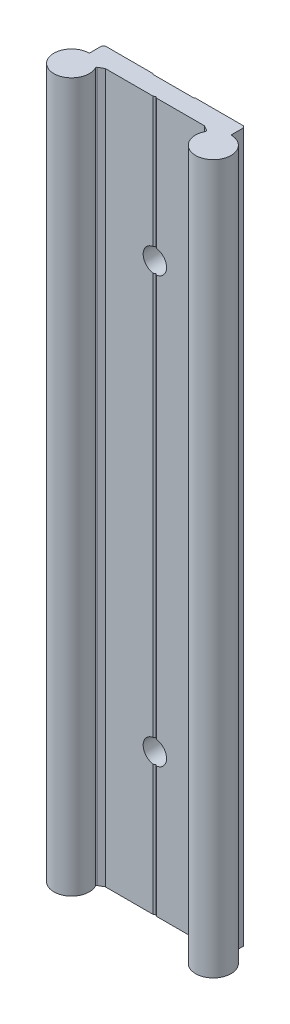
ISO-10303-21;
HEADER;
FILE_DESCRIPTION(('STEP AP214'),'2;1');
FILE_NAME('part.step','',(''),(''),'','','');
FILE_SCHEMA(('AUTOMOTIVE_DESIGN { 1 0 10303 214 1 1 1 1 }'));
ENDSEC;
DATA;
#1=APPLICATION_CONTEXT('core data for automotive mechanical design processes');
#2=APPLICATION_PROTOCOL_DEFINITION('international standard','automotive_design',2000,#1);
#3=PRODUCT_CONTEXT('',#1,'mechanical');
#4=PRODUCT('Part','Part','',(#3));
#5=PRODUCT_RELATED_PRODUCT_CATEGORY('part','',(#4));
#6=PRODUCT_DEFINITION_FORMATION('','',#4);
#7=PRODUCT_DEFINITION_CONTEXT('part definition',#1,'design');
#8=PRODUCT_DEFINITION('design','',#6,#7);
#9=PRODUCT_DEFINITION_SHAPE('','',#8);
#10=(LENGTH_UNIT() NAMED_UNIT(*) SI_UNIT(.MILLI.,.METRE.));
#11=(NAMED_UNIT(*) PLANE_ANGLE_UNIT() SI_UNIT($,.RADIAN.));
#12=(NAMED_UNIT(*) SI_UNIT($,.STERADIAN.) SOLID_ANGLE_UNIT());
#13=UNCERTAINTY_MEASURE_WITH_UNIT(LENGTH_MEASURE(1.E-05),#10,'distance_accuracy_value','');
#14=(GEOMETRIC_REPRESENTATION_CONTEXT(3) GLOBAL_UNCERTAINTY_ASSIGNED_CONTEXT((#13)) GLOBAL_UNIT_ASSIGNED_CONTEXT((#10,
#11,#12)) REPRESENTATION_CONTEXT('',''));
#15=CARTESIAN_POINT('',(0.,0.,0.));
#16=DIRECTION('',(0.,0.,1.));
#17=DIRECTION('',(1.,0.,0.));
#18=AXIS2_PLACEMENT_3D('',#15,#16,#17);
#19=CARTESIAN_POINT('',(6.,0.,0.));
#20=DIRECTION('',(-0.707106781186547,0.,-0.707106781186548));
#21=DIRECTION('',(-0.707106781186548,0.,0.707106781186547));
#22=AXIS2_PLACEMENT_3D('',#19,#20,#21);
#23=PLANE('',#22);
#24=DIRECTION('',(-0.707106781186548,0.,0.707106781186547));
#25=VECTOR('',#24,1.);
#26=CARTESIAN_POINT('',(5.9,0.,0.1));
#27=LINE('',#26,#25);
#28=CARTESIAN_POINT('',(6.,0.,0.));
#29=VERTEX_POINT('',#28);
#30=CARTESIAN_POINT('',(5.8,0.,0.2));
#31=VERTEX_POINT('',#30);
#32=EDGE_CURVE('E385',#29,#31,#27,.T.);
#33=ORIENTED_EDGE('',*,*,#32,.T.);
#34=DIRECTION('',(0.,-1.,0.));
#35=VECTOR('',#34,1.);
#36=CARTESIAN_POINT('',(5.8,100.,0.2));
#37=LINE('',#36,#35);
#38=CARTESIAN_POINT('',(5.8,200.,0.2));
#39=VERTEX_POINT('',#38);
#40=EDGE_CURVE('E313',#39,#31,#37,.T.);
#41=ORIENTED_EDGE('',*,*,#40,.F.);
#42=DIRECTION('',(0.707106781186548,0.,-0.707106781186547));
#43=VECTOR('',#42,1.);
#44=CARTESIAN_POINT('',(5.9,200.,0.1));
#45=LINE('',#44,#43);
#46=CARTESIAN_POINT('',(6.,200.,0.));
#47=VERTEX_POINT('',#46);
#48=EDGE_CURVE('E390',#39,#47,#45,.T.);
#49=ORIENTED_EDGE('',*,*,#48,.T.);
#50=DIRECTION('',(0.,1.,0.));
#51=VECTOR('',#50,1.);
#52=CARTESIAN_POINT('',(6.,100.,0.));
#53=LINE('',#52,#51);
#54=EDGE_CURVE('E238',#29,#47,#53,.T.);
#55=ORIENTED_EDGE('',*,*,#54,.F.);
#56=EDGE_LOOP('',(#33,#41,#49,#55));
#57=FACE_BOUND('',#56,.T.);
#58=ADVANCED_FACE('F16',(#57),#23,.T.);
#59=CARTESIAN_POINT('',(20.,0.,0.5));
#60=DIRECTION('',(0.707106781186547,0.,-0.707106781186548));
#61=DIRECTION('',(-0.707106781186548,0.,-0.707106781186547));
#62=AXIS2_PLACEMENT_3D('',#59,#60,#61);
#63=PLANE('',#62);
#64=DIRECTION('',(-0.707106781186548,0.,-0.707106781186547));
#65=VECTOR('',#64,1.);
#66=CARTESIAN_POINT('',(19.75,0.,0.25));
#67=LINE('',#66,#65);
#68=CARTESIAN_POINT('',(20.,0.,0.5));
#69=VERTEX_POINT('',#68);
#70=CARTESIAN_POINT('',(19.5,0.,0.));
#71=VERTEX_POINT('',#70);
#72=EDGE_CURVE('E142',#69,#71,#67,.T.);
#73=ORIENTED_EDGE('',*,*,#72,.T.);
#74=DIRECTION('',(0.,-1.,0.));
#75=VECTOR('',#74,1.);
#76=CARTESIAN_POINT('',(19.5,100.,0.));
#77=LINE('',#76,#75);
#78=CARTESIAN_POINT('',(19.5,200.,0.));
#79=VERTEX_POINT('',#78);
#80=EDGE_CURVE('E192',#79,#71,#77,.T.);
#81=ORIENTED_EDGE('',*,*,#80,.F.);
#82=DIRECTION('',(0.707106781186548,0.,0.707106781186547));
#83=VECTOR('',#82,1.);
#84=CARTESIAN_POINT('',(19.75,200.,0.25));
#85=LINE('',#84,#83);
#86=CARTESIAN_POINT('',(20.,200.,0.5));
#87=VERTEX_POINT('',#86);
#88=EDGE_CURVE('E381',#79,#87,#85,.T.);
#89=ORIENTED_EDGE('',*,*,#88,.T.);
#90=DIRECTION('',(0.,1.,0.));
#91=VECTOR('',#90,1.);
#92=CARTESIAN_POINT('',(20.,100.,0.5));
#93=LINE('',#92,#91);
#94=EDGE_CURVE('E152',#69,#87,#93,.T.);
#95=ORIENTED_EDGE('',*,*,#94,.F.);
#96=EDGE_LOOP('',(#73,#81,#89,#95));
#97=FACE_BOUND('',#96,.T.);
#98=ADVANCED_FACE('F529',(#97),#63,.T.);
#99=CARTESIAN_POINT('',(20.3,0.,3.70849738000001));
#100=DIRECTION('',(0.,1.,0.));
#101=DIRECTION('',(0.,0.,1.));
#102=AXIS2_PLACEMENT_3D('',#99,#100,#101);
#103=CYLINDRICAL_SURFACE('',#102,0.300000003529736);
#104=CARTESIAN_POINT('',(20.3,0.,3.70849738000001));
#105=DIRECTION('',(0.,1.,0.));
#106=DIRECTION('',(0.,0.,1.));
#107=AXIS2_PLACEMENT_3D('',#104,#105,#106);
#108=CIRCLE('',#107,0.300000003529736);
#109=CARTESIAN_POINT('',(20.2830188688939,0.,4.00801639931802));
#110=VERTEX_POINT('',#109);
#111=CARTESIAN_POINT('',(20.,0.,3.70849738));
#112=VERTEX_POINT('',#111);
#113=EDGE_CURVE('E141',#110,#112,#108,.F.);
#114=ORIENTED_EDGE('',*,*,#113,.T.);
#115=DIRECTION('',(0.,-1.,0.));
#116=VECTOR('',#115,1.);
#117=CARTESIAN_POINT('',(20.,100.,3.70849738));
#118=LINE('',#117,#116);
#119=CARTESIAN_POINT('',(20.,200.,3.70849738));
#120=VERTEX_POINT('',#119);
#121=EDGE_CURVE('E139',#120,#112,#118,.T.);
#122=ORIENTED_EDGE('',*,*,#121,.F.);
#123=CARTESIAN_POINT('',(20.3,200.,3.70849738000001));
#124=DIRECTION('',(0.,1.,0.));
#125=DIRECTION('',(0.,0.,1.));
#126=AXIS2_PLACEMENT_3D('',#123,#124,#125);
#127=CIRCLE('',#126,0.300000003529736);
#128=CARTESIAN_POINT('',(20.283018868894,200.,4.00801639931803));
#129=VERTEX_POINT('',#128);
#130=EDGE_CURVE('E20',#120,#129,#127,.T.);
#131=ORIENTED_EDGE('',*,*,#130,.T.);
#132=DIRECTION('',(0.,1.,0.));
#133=VECTOR('',#132,1.);
#134=CARTESIAN_POINT('',(20.28301887007,100.,4.00801639876542));
#135=LINE('',#134,#133);
#136=EDGE_CURVE('E137',#110,#129,#135,.T.);
#137=ORIENTED_EDGE('',*,*,#136,.F.);
#138=EDGE_LOOP('',(#114,#122,#131,#137));
#139=FACE_BOUND('',#138,.T.);
#140=ADVANCED_FACE('F136',(#139),#103,.F.);
#141=CARTESIAN_POINT('',(15.28152165,0.,6.58629703));
#142=DIRECTION('',(0.,1.,0.));
#143=DIRECTION('',(0.,0.,1.));
#144=AXIS2_PLACEMENT_3D('',#141,#142,#143);
#145=CYLINDRICAL_SURFACE('',#144,0.299999999016778);
#146=CARTESIAN_POINT('',(15.28152165,0.,6.58629703));
#147=DIRECTION('',(0.,1.,0.));
#148=DIRECTION('',(0.,0.,1.));
#149=AXIS2_PLACEMENT_3D('',#146,#147,#148);
#150=CIRCLE('',#149,0.299999999016778);
#151=CARTESIAN_POINT('',(15.4315216497557,0.,6.32648940985893));
#152=VERTEX_POINT('',#151);
#153=CARTESIAN_POINT('',(15.5486053297356,0.,6.722921728024));
#154=VERTEX_POINT('',#153);
#155=EDGE_CURVE('E229',#152,#154,#150,.F.);
#156=ORIENTED_EDGE('',*,*,#155,.T.);
#157=DIRECTION('',(0.,-1.,0.));
#158=VECTOR('',#157,1.);
#159=CARTESIAN_POINT('',(15.54860533,100.,6.72292172999999));
#160=LINE('',#159,#158);
#161=CARTESIAN_POINT('',(15.5486053297356,200.,6.72292172802402));
#162=VERTEX_POINT('',#161);
#163=EDGE_CURVE('E151',#162,#154,#160,.T.);
#164=ORIENTED_EDGE('',*,*,#163,.F.);
#165=CARTESIAN_POINT('',(15.28152165,200.,6.58629703));
#166=DIRECTION('',(0.,1.,0.));
#167=DIRECTION('',(0.,0.,1.));
#168=AXIS2_PLACEMENT_3D('',#165,#166,#167);
#169=CIRCLE('',#168,0.299999999016778);
#170=CARTESIAN_POINT('',(15.4315216497557,200.,6.32648940985893));
#171=VERTEX_POINT('',#170);
#172=EDGE_CURVE('E157',#162,#171,#169,.T.);
#173=ORIENTED_EDGE('',*,*,#172,.T.);
#174=DIRECTION('',(0.,1.,0.));
#175=VECTOR('',#174,1.);
#176=CARTESIAN_POINT('',(15.43152165,100.,6.32648941));
#177=LINE('',#176,#175);
#178=EDGE_CURVE('E366',#152,#171,#177,.T.);
#179=ORIENTED_EDGE('',*,*,#178,.F.);
#180=EDGE_LOOP('',(#156,#164,#173,#179));
#181=FACE_BOUND('',#180,.T.);
#182=ADVANCED_FACE('F538',(#181),#145,.F.);
#183=CARTESIAN_POINT('',(0.,43.26190128606,5.21132487));
#184=DIRECTION('',(-0.499999994031163,0.,0.866025407230548));
#185=DIRECTION('',(0.866025407230548,0.,0.499999994031163));
#186=AXIS2_PLACEMENT_3D('',#183,#184,#185);
#187=PLANE('',#186);
#188=CARTESIAN_POINT('',(0.,40.,5.21132487));
#189=DIRECTION('',(-0.499999994031163,0.,0.866025407230548));
#190=DIRECTION('',(-0.866025407230548,0.,-0.499999994031163));
#191=AXIS2_PLACEMENT_3D('',#188,#189,#190);
#192=ELLIPSE('',#191,3.81051176148865,3.3);
#193=CARTESIAN_POINT('',(0.500000000000001,43.26190128606,5.5));
#194=VERTEX_POINT('',#193);
#195=CARTESIAN_POINT('',(0.,43.3,5.21132487));
#196=VERTEX_POINT('',#195);
#197=EDGE_CURVE('E212',#194,#196,#192,.T.);
#198=ORIENTED_EDGE('',*,*,#197,.F.);
#199=DIRECTION('',(0.,-1.,0.));
#200=VECTOR('',#199,1.);
#201=CARTESIAN_POINT('',(0.5,100.,5.5));
#202=LINE('',#201,#200);
#203=CARTESIAN_POINT('',(0.5,156.73809871394,5.5));
#204=VERTEX_POINT('',#203);
#205=EDGE_CURVE('E185',#204,#194,#202,.T.);
#206=ORIENTED_EDGE('',*,*,#205,.F.);
#207=CARTESIAN_POINT('',(0.,160.,5.21132487));
#208=DIRECTION('',(-0.499999994031163,0.,0.866025407230548));
#209=DIRECTION('',(-0.866025407230548,0.,-0.499999994031163));
#210=AXIS2_PLACEMENT_3D('',#207,#208,#209);
#211=ELLIPSE('',#210,3.81051176148866,3.30000000000001);
#212=CARTESIAN_POINT('',(0.,156.7,5.21132487));
#213=VERTEX_POINT('',#212);
#214=EDGE_CURVE('E226',#213,#204,#211,.T.);
#215=ORIENTED_EDGE('',*,*,#214,.F.);
#216=DIRECTION('',(0.,1.,0.));
#217=VECTOR('',#216,1.);
#218=CARTESIAN_POINT('',(0.,100.,5.21132487));
#219=LINE('',#218,#217);
#220=EDGE_CURVE('E208',#196,#213,#219,.T.);
#221=ORIENTED_EDGE('',*,*,#220,.F.);
#222=EDGE_LOOP('',(#198,#206,#215,#221));
#223=FACE_BOUND('',#222,.T.);
#224=ADVANCED_FACE('F616',(#223),#187,.T.);
#225=CARTESIAN_POINT('',(0.,0.,5.21132487));
#226=DIRECTION('',(-0.499999994031163,0.,0.866025407230548));
#227=DIRECTION('',(0.866025407230548,0.,0.499999994031163));
#228=AXIS2_PLACEMENT_3D('',#225,#226,#227);
#229=PLANE('',#228);
#230=DIRECTION('',(0.866025407230548,0.,0.499999994031163));
#231=VECTOR('',#230,1.);
#232=CARTESIAN_POINT('',(0.25,0.,5.355662435));
#233=LINE('',#232,#231);
#234=CARTESIAN_POINT('',(0.,0.,5.21132487));
#235=VERTEX_POINT('',#234);
#236=CARTESIAN_POINT('',(0.5,0.,5.5));
#237=VERTEX_POINT('',#236);
#238=EDGE_CURVE('E231',#235,#237,#233,.T.);
#239=ORIENTED_EDGE('',*,*,#238,.T.);
#240=DIRECTION('',(0.,-1.,0.));
#241=VECTOR('',#240,1.);
#242=CARTESIAN_POINT('',(0.5,100.,5.5));
#243=LINE('',#242,#241);
#244=CARTESIAN_POINT('',(0.5,36.73809871394,5.5));
#245=VERTEX_POINT('',#244);
#246=EDGE_CURVE('E184',#245,#237,#243,.T.);
#247=ORIENTED_EDGE('',*,*,#246,.F.);
#248=CARTESIAN_POINT('',(0.,40.,5.21132487));
#249=DIRECTION('',(-0.499999994031163,0.,0.866025407230548));
#250=DIRECTION('',(-0.866025407230548,0.,-0.499999994031163));
#251=AXIS2_PLACEMENT_3D('',#248,#249,#250);
#252=ELLIPSE('',#251,3.81051176148865,3.3);
#253=CARTESIAN_POINT('',(0.,36.7,5.21132487));
#254=VERTEX_POINT('',#253);
#255=EDGE_CURVE('E214',#254,#245,#252,.T.);
#256=ORIENTED_EDGE('',*,*,#255,.F.);
#257=DIRECTION('',(0.,1.,0.));
#258=VECTOR('',#257,1.);
#259=CARTESIAN_POINT('',(0.,18.36904935697,5.21132487));
#260=LINE('',#259,#258);
#261=EDGE_CURVE('E219',#235,#254,#260,.T.);
#262=ORIENTED_EDGE('',*,*,#261,.F.);
#263=EDGE_LOOP('',(#239,#247,#256,#262));
#264=FACE_BOUND('',#263,.T.);
#265=ADVANCED_FACE('F612',(#264),#229,.T.);
#266=CARTESIAN_POINT('',(14.,0.,5.5));
#267=DIRECTION('',(-0.500000000009857,0.,0.866025403778748));
#268=DIRECTION('',(0.866025403778748,0.,0.500000000009857));
#269=AXIS2_PLACEMENT_3D('',#266,#267,#268);
#270=PLANE('',#269);
#271=DIRECTION('',(0.866025403778748,0.,0.500000000009857));
#272=VECTOR('',#271,1.);
#273=CARTESIAN_POINT('',(14.715760825,0.,5.913244705));
#274=LINE('',#273,#272);
#275=CARTESIAN_POINT('',(14.,0.,5.5));
#276=VERTEX_POINT('',#275);
#277=EDGE_CURVE('E419',#276,#152,#274,.T.);
#278=ORIENTED_EDGE('',*,*,#277,.T.);
#279=ORIENTED_EDGE('',*,*,#178,.T.);
#280=DIRECTION('',(-0.866025403778748,0.,-0.500000000009857));
#281=VECTOR('',#280,1.);
#282=CARTESIAN_POINT('',(14.715760825,200.,5.913244705));
#283=LINE('',#282,#281);
#284=CARTESIAN_POINT('',(14.,200.,5.5));
#285=VERTEX_POINT('',#284);
#286=EDGE_CURVE('E373',#171,#285,#283,.T.);
#287=ORIENTED_EDGE('',*,*,#286,.T.);
#288=DIRECTION('',(0.,1.,0.));
#289=VECTOR('',#288,1.);
#290=CARTESIAN_POINT('',(14.,100.,5.5));
#291=LINE('',#290,#289);
#292=EDGE_CURVE('E296',#276,#285,#291,.T.);
#293=ORIENTED_EDGE('',*,*,#292,.F.);
#294=EDGE_LOOP('',(#278,#279,#287,#293));
#295=FACE_BOUND('',#294,.T.);
#296=ADVANCED_FACE('F608',(#295),#270,.T.);
#297=CARTESIAN_POINT('',(0.,163.26190128606,5.21132487));
#298=DIRECTION('',(-0.499999994031163,0.,0.866025407230548));
#299=DIRECTION('',(0.866025407230548,0.,0.499999994031163));
#300=AXIS2_PLACEMENT_3D('',#297,#298,#299);
#301=PLANE('',#300);
#302=DIRECTION('',(-0.866025407230548,0.,-0.499999994031163));
#303=VECTOR('',#302,1.);
#304=CARTESIAN_POINT('',(0.25,200.,5.355662435));
#305=LINE('',#304,#303);
#306=CARTESIAN_POINT('',(0.5,200.,5.5));
#307=VERTEX_POINT('',#306);
#308=CARTESIAN_POINT('',(0.,200.,5.21132487));
#309=VERTEX_POINT('',#308);
#310=EDGE_CURVE('E228',#307,#309,#305,.T.);
#311=ORIENTED_EDGE('',*,*,#310,.T.);
#312=DIRECTION('',(0.,1.,0.));
#313=VECTOR('',#312,1.);
#314=CARTESIAN_POINT('',(0.,181.63095064303,5.21132487));
#315=LINE('',#314,#313);
#316=CARTESIAN_POINT('',(0.,163.3,5.21132487));
#317=VERTEX_POINT('',#316);
#318=EDGE_CURVE('E223',#317,#309,#315,.T.);
#319=ORIENTED_EDGE('',*,*,#318,.F.);
#320=CARTESIAN_POINT('',(0.,160.,5.21132487));
#321=DIRECTION('',(-0.499999994031163,0.,0.866025407230548));
#322=DIRECTION('',(-0.866025407230548,0.,-0.499999994031163));
#323=AXIS2_PLACEMENT_3D('',#320,#321,#322);
#324=ELLIPSE('',#323,3.81051176148866,3.30000000000001);
#325=CARTESIAN_POINT('',(0.5,163.26190128606,5.5));
#326=VERTEX_POINT('',#325);
#327=EDGE_CURVE('E224',#326,#317,#324,.T.);
#328=ORIENTED_EDGE('',*,*,#327,.F.);
#329=DIRECTION('',(0.,-1.,0.));
#330=VECTOR('',#329,1.);
#331=CARTESIAN_POINT('',(0.5,100.,5.5));
#332=LINE('',#331,#330);
#333=EDGE_CURVE('E180',#307,#326,#332,.T.);
#334=ORIENTED_EDGE('',*,*,#333,.F.);
#335=EDGE_LOOP('',(#311,#319,#328,#334));
#336=FACE_BOUND('',#335,.T.);
#337=ADVANCED_FACE('F604',(#336),#301,.T.);
#338=CARTESIAN_POINT('',(0.,160.,5.5));
#339=DIRECTION('',(0.,0.,-1.));
#340=DIRECTION('',(-1.,0.,0.));
#341=AXIS2_PLACEMENT_3D('',#338,#339,#340);
#342=CYLINDRICAL_SURFACE('',#341,3.30000000000001);
#343=CARTESIAN_POINT('',(0.,160.,5.5));
#344=DIRECTION('',(0.,0.,-1.));
#345=DIRECTION('',(-1.,0.,0.));
#346=AXIS2_PLACEMENT_3D('',#343,#344,#345);
#347=CIRCLE('',#346,3.30000000000001);
#348=EDGE_CURVE('E186',#326,#204,#347,.T.);
#349=ORIENTED_EDGE('',*,*,#348,.F.);
#350=ORIENTED_EDGE('',*,*,#327,.T.);
#351=CARTESIAN_POINT('',(0.,160.,5.21132487));
#352=DIRECTION('',(0.499999994031163,0.,0.866025407230548));
#353=DIRECTION('',(0.866025407230548,0.,-0.499999994031163));
#354=AXIS2_PLACEMENT_3D('',#351,#352,#353);
#355=ELLIPSE('',#354,3.81051176148866,3.30000000000001);
#356=CARTESIAN_POINT('',(-0.5,163.26190128606,5.5));
#357=VERTEX_POINT('',#356);
#358=EDGE_CURVE('E220',#357,#317,#355,.F.);
#359=ORIENTED_EDGE('',*,*,#358,.F.);
#360=CARTESIAN_POINT('',(0.,160.,5.5));
#361=DIRECTION('',(0.,0.,-1.));
#362=DIRECTION('',(-1.,0.,0.));
#363=AXIS2_PLACEMENT_3D('',#360,#361,#362);
#364=CIRCLE('',#363,3.30000000000001);
#365=CARTESIAN_POINT('',(-0.5,156.73809871394,5.5));
#366=VERTEX_POINT('',#365);
#367=EDGE_CURVE('E176',#366,#357,#364,.T.);
#368=ORIENTED_EDGE('',*,*,#367,.F.);
#369=CARTESIAN_POINT('',(0.,160.,5.21132487));
#370=DIRECTION('',(0.499999994031163,0.,0.866025407230548));
#371=DIRECTION('',(0.866025407230548,0.,-0.499999994031163));
#372=AXIS2_PLACEMENT_3D('',#369,#370,#371);
#373=ELLIPSE('',#372,3.81051176148866,3.30000000000001);
#374=EDGE_CURVE('E209',#213,#366,#373,.F.);
#375=ORIENTED_EDGE('',*,*,#374,.F.);
#376=ORIENTED_EDGE('',*,*,#214,.T.);
#377=EDGE_LOOP('',(#349,#350,#359,#368,#375,#376));
#378=FACE_BOUND('',#377,.T.);
#379=CARTESIAN_POINT('',(0.,160.,0.2));
#380=DIRECTION('',(0.,0.,-1.));
#381=DIRECTION('',(-1.,0.,0.));
#382=AXIS2_PLACEMENT_3D('',#379,#380,#381);
#383=CIRCLE('',#382,3.30000000000001);
#384=CARTESIAN_POINT('',(-3.30000000000001,160.,0.2));
#385=VERTEX_POINT('',#384);
#386=EDGE_CURVE('E193',#385,#385,#383,.F.);
#387=ORIENTED_EDGE('',*,*,#386,.F.);
#388=EDGE_LOOP('',(#387));
#389=FACE_BOUND('',#388,.T.);
#390=ADVANCED_FACE('F600',(#378,#389),#342,.F.);
#391=CARTESIAN_POINT('',(-0.5,163.26190128606,5.5));
#392=DIRECTION('',(0.499999994031163,0.,0.866025407230548));
#393=DIRECTION('',(0.866025407230548,0.,-0.499999994031163));
#394=AXIS2_PLACEMENT_3D('',#391,#392,#393);
#395=PLANE('',#394);
#396=DIRECTION('',(-0.866025407230548,0.,0.499999994031163));
#397=VECTOR('',#396,1.);
#398=CARTESIAN_POINT('',(-0.25,200.,5.355662435));
#399=LINE('',#398,#397);
#400=CARTESIAN_POINT('',(-0.5,200.,5.5));
#401=VERTEX_POINT('',#400);
#402=EDGE_CURVE('E352',#309,#401,#399,.T.);
#403=ORIENTED_EDGE('',*,*,#402,.T.);
#404=DIRECTION('',(0.,1.,0.));
#405=VECTOR('',#404,1.);
#406=CARTESIAN_POINT('',(-0.5,100.,5.5));
#407=LINE('',#406,#405);
#408=EDGE_CURVE('E179',#357,#401,#407,.T.);
#409=ORIENTED_EDGE('',*,*,#408,.F.);
#410=ORIENTED_EDGE('',*,*,#358,.T.);
#411=ORIENTED_EDGE('',*,*,#318,.T.);
#412=EDGE_LOOP('',(#403,#409,#410,#411));
#413=FACE_BOUND('',#412,.T.);
#414=ADVANCED_FACE('F596',(#413),#395,.T.);
#415=CARTESIAN_POINT('',(-15.4315216508515,0.,6.3264894104916));
#416=DIRECTION('',(0.500000000009856,0.,0.866025403778748));
#417=DIRECTION('',(0.866025403778748,0.,-0.500000000009856));
#418=AXIS2_PLACEMENT_3D('',#415,#416,#417);
#419=PLANE('',#418);
#420=DIRECTION('',(0.866025403778748,0.,-0.500000000009856));
#421=VECTOR('',#420,1.);
#422=CARTESIAN_POINT('',(-14.7157608254257,0.,5.9132447052458));
#423=LINE('',#422,#421);
#424=CARTESIAN_POINT('',(-15.4315216503233,0.,6.32648940887573));
#425=VERTEX_POINT('',#424);
#426=CARTESIAN_POINT('',(-14.,0.,5.5));
#427=VERTEX_POINT('',#426);
#428=EDGE_CURVE('E341',#425,#427,#423,.T.);
#429=ORIENTED_EDGE('',*,*,#428,.T.);
#430=DIRECTION('',(0.,-1.,0.));
#431=VECTOR('',#430,1.);
#432=CARTESIAN_POINT('',(-14.,100.,5.5));
#433=LINE('',#432,#431);
#434=CARTESIAN_POINT('',(-14.,200.,5.5));
#435=VERTEX_POINT('',#434);
#436=EDGE_CURVE('E287',#435,#427,#433,.T.);
#437=ORIENTED_EDGE('',*,*,#436,.F.);
#438=DIRECTION('',(-0.866025403778748,0.,0.500000000009856));
#439=VECTOR('',#438,1.);
#440=CARTESIAN_POINT('',(-14.7157608254257,200.,5.9132447052458));
#441=LINE('',#440,#439);
#442=CARTESIAN_POINT('',(-15.4315216503233,200.,6.32648940887573));
#443=VERTEX_POINT('',#442);
#444=EDGE_CURVE('E357',#435,#443,#441,.T.);
#445=ORIENTED_EDGE('',*,*,#444,.T.);
#446=DIRECTION('',(0.,1.,0.));
#447=VECTOR('',#446,1.);
#448=CARTESIAN_POINT('',(-15.4315216511353,100.,6.32648940803359));
#449=LINE('',#448,#447);
#450=EDGE_CURVE('E200',#425,#443,#449,.T.);
#451=ORIENTED_EDGE('',*,*,#450,.F.);
#452=EDGE_LOOP('',(#429,#437,#445,#451));
#453=FACE_BOUND('',#452,.T.);
#454=ADVANCED_FACE('F592',(#453),#419,.T.);
#455=CARTESIAN_POINT('',(-0.5,0.,5.5));
#456=DIRECTION('',(0.499999994031163,0.,0.866025407230548));
#457=DIRECTION('',(0.866025407230548,0.,-0.499999994031163));
#458=AXIS2_PLACEMENT_3D('',#455,#456,#457);
#459=PLANE('',#458);
#460=DIRECTION('',(0.866025407230548,0.,-0.499999994031163));
#461=VECTOR('',#460,1.);
#462=CARTESIAN_POINT('',(-0.25,0.,5.355662435));
#463=LINE('',#462,#461);
#464=CARTESIAN_POINT('',(-0.5,0.,5.5));
#465=VERTEX_POINT('',#464);
#466=EDGE_CURVE('E336',#465,#235,#463,.T.);
#467=ORIENTED_EDGE('',*,*,#466,.T.);
#468=ORIENTED_EDGE('',*,*,#261,.T.);
#469=CARTESIAN_POINT('',(0.,40.,5.21132487));
#470=DIRECTION('',(0.499999994031163,0.,0.866025407230548));
#471=DIRECTION('',(0.866025407230548,0.,-0.499999994031163));
#472=AXIS2_PLACEMENT_3D('',#469,#470,#471);
#473=ELLIPSE('',#472,3.81051176148865,3.3);
#474=CARTESIAN_POINT('',(-0.5,36.73809871394,5.5));
#475=VERTEX_POINT('',#474);
#476=EDGE_CURVE('E216',#475,#254,#473,.T.);
#477=ORIENTED_EDGE('',*,*,#476,.F.);
#478=DIRECTION('',(0.,1.,0.));
#479=VECTOR('',#478,1.);
#480=CARTESIAN_POINT('',(-0.5,100.,5.5));
#481=LINE('',#480,#479);
#482=EDGE_CURVE('E175',#465,#475,#481,.T.);
#483=ORIENTED_EDGE('',*,*,#482,.F.);
#484=EDGE_LOOP('',(#467,#468,#477,#483));
#485=FACE_BOUND('',#484,.T.);
#486=ADVANCED_FACE('F588',(#485),#459,.T.);
#487=CARTESIAN_POINT('',(0.,40.,5.5));
#488=DIRECTION('',(0.,0.,-1.));
#489=DIRECTION('',(-1.,0.,0.));
#490=AXIS2_PLACEMENT_3D('',#487,#488,#489);
#491=CYLINDRICAL_SURFACE('',#490,3.3);
#492=CARTESIAN_POINT('',(0.,40.,5.5));
#493=DIRECTION('',(0.,0.,-1.));
#494=DIRECTION('',(-1.,0.,0.));
#495=AXIS2_PLACEMENT_3D('',#492,#493,#494);
#496=CIRCLE('',#495,3.3);
#497=EDGE_CURVE('E181',#194,#245,#496,.T.);
#498=ORIENTED_EDGE('',*,*,#497,.F.);
#499=ORIENTED_EDGE('',*,*,#197,.T.);
#500=CARTESIAN_POINT('',(0.,40.,5.21132487));
#501=DIRECTION('',(0.499999994031163,0.,0.866025407230548));
#502=DIRECTION('',(0.866025407230548,0.,-0.499999994031163));
#503=AXIS2_PLACEMENT_3D('',#500,#501,#502);
#504=ELLIPSE('',#503,3.81051176148865,3.3);
#505=CARTESIAN_POINT('',(-0.5,43.26190128606,5.5));
#506=VERTEX_POINT('',#505);
#507=EDGE_CURVE('E205',#506,#196,#504,.F.);
#508=ORIENTED_EDGE('',*,*,#507,.F.);
#509=CARTESIAN_POINT('',(0.,40.,5.5));
#510=DIRECTION('',(0.,0.,-1.));
#511=DIRECTION('',(-1.,0.,0.));
#512=AXIS2_PLACEMENT_3D('',#509,#510,#511);
#513=CIRCLE('',#512,3.3);
#514=EDGE_CURVE('E171',#475,#506,#513,.T.);
#515=ORIENTED_EDGE('',*,*,#514,.F.);
#516=ORIENTED_EDGE('',*,*,#476,.T.);
#517=ORIENTED_EDGE('',*,*,#255,.T.);
#518=EDGE_LOOP('',(#498,#499,#508,#515,#516,#517));
#519=FACE_BOUND('',#518,.T.);
#520=CARTESIAN_POINT('',(0.,40.,0.2));
#521=DIRECTION('',(0.,0.,-1.));
#522=DIRECTION('',(-1.,0.,0.));
#523=AXIS2_PLACEMENT_3D('',#520,#521,#522);
#524=CIRCLE('',#523,3.3);
#525=CARTESIAN_POINT('',(-3.3,40.,0.2));
#526=VERTEX_POINT('',#525);
#527=EDGE_CURVE('E189',#526,#526,#524,.F.);
#528=ORIENTED_EDGE('',*,*,#527,.F.);
#529=EDGE_LOOP('',(#528));
#530=FACE_BOUND('',#529,.T.);
#531=ADVANCED_FACE('F584',(#519,#530),#491,.F.);
#532=CARTESIAN_POINT('',(-0.5,43.26190128606,5.5));
#533=DIRECTION('',(0.499999994031163,0.,0.866025407230548));
#534=DIRECTION('',(0.866025407230548,0.,-0.499999994031163));
#535=AXIS2_PLACEMENT_3D('',#532,#533,#534);
#536=PLANE('',#535);
#537=ORIENTED_EDGE('',*,*,#507,.T.);
#538=ORIENTED_EDGE('',*,*,#220,.T.);
#539=ORIENTED_EDGE('',*,*,#374,.T.);
#540=DIRECTION('',(0.,1.,0.));
#541=VECTOR('',#540,1.);
#542=CARTESIAN_POINT('',(-0.5,100.,5.5));
#543=LINE('',#542,#541);
#544=EDGE_CURVE('E174',#506,#366,#543,.T.);
#545=ORIENTED_EDGE('',*,*,#544,.F.);
#546=EDGE_LOOP('',(#537,#538,#539,#545));
#547=FACE_BOUND('',#546,.T.);
#548=ADVANCED_FACE('F581',(#547),#536,.T.);
#549=CARTESIAN_POINT('',(-5.8,0.,0.2));
#550=DIRECTION('',(0.707106781186547,0.,-0.707106781186548));
#551=DIRECTION('',(-0.707106781186548,0.,-0.707106781186547));
#552=AXIS2_PLACEMENT_3D('',#549,#550,#551);
#553=PLANE('',#552);
#554=DIRECTION('',(-0.707106781186548,0.,-0.707106781186547));
#555=VECTOR('',#554,1.);
#556=CARTESIAN_POINT('',(-5.9,0.,0.1));
#557=LINE('',#556,#555);
#558=CARTESIAN_POINT('',(-5.8,0.,0.2));
#559=VERTEX_POINT('',#558);
#560=CARTESIAN_POINT('',(-6.,0.,0.));
#561=VERTEX_POINT('',#560);
#562=EDGE_CURVE('E318',#559,#561,#557,.T.);
#563=ORIENTED_EDGE('',*,*,#562,.T.);
#564=DIRECTION('',(0.,-1.,0.));
#565=VECTOR('',#564,1.);
#566=CARTESIAN_POINT('',(-6.,100.,0.));
#567=LINE('',#566,#565);
#568=CARTESIAN_POINT('',(-6.,200.,0.));
#569=VERTEX_POINT('',#568);
#570=EDGE_CURVE('E275',#569,#561,#567,.T.);
#571=ORIENTED_EDGE('',*,*,#570,.F.);
#572=DIRECTION('',(0.707106781186548,0.,0.707106781186547));
#573=VECTOR('',#572,1.);
#574=CARTESIAN_POINT('',(-5.9,200.,0.1));
#575=LINE('',#574,#573);
#576=CARTESIAN_POINT('',(-5.8,200.,0.2));
#577=VERTEX_POINT('',#576);
#578=EDGE_CURVE('E322',#569,#577,#575,.T.);
#579=ORIENTED_EDGE('',*,*,#578,.T.);
#580=DIRECTION('',(0.,1.,0.));
#581=VECTOR('',#580,1.);
#582=CARTESIAN_POINT('',(-5.8,100.,0.2));
#583=LINE('',#582,#581);
#584=EDGE_CURVE('E196',#559,#577,#583,.T.);
#585=ORIENTED_EDGE('',*,*,#584,.F.);
#586=EDGE_LOOP('',(#563,#571,#579,#585));
#587=FACE_BOUND('',#586,.T.);
#588=ADVANCED_FACE('F514',(#587),#553,.T.);
#589=CARTESIAN_POINT('',(-19.5,0.,0.));
#590=DIRECTION('',(-0.707106781186547,0.,-0.707106781186548));
#591=DIRECTION('',(-0.707106781186548,0.,0.707106781186547));
#592=AXIS2_PLACEMENT_3D('',#589,#590,#591);
#593=PLANE('',#592);
#594=DIRECTION('',(-0.707106781186548,0.,0.707106781186547));
#595=VECTOR('',#594,1.);
#596=CARTESIAN_POINT('',(-19.75,0.,0.25));
#597=LINE('',#596,#595);
#598=CARTESIAN_POINT('',(-19.5,0.,0.));
#599=VERTEX_POINT('',#598);
#600=CARTESIAN_POINT('',(-20.,0.,0.5));
#601=VERTEX_POINT('',#600);
#602=EDGE_CURVE('E204',#599,#601,#597,.T.);
#603=ORIENTED_EDGE('',*,*,#602,.T.);
#604=DIRECTION('',(0.,-1.,0.));
#605=VECTOR('',#604,1.);
#606=CARTESIAN_POINT('',(-20.,100.,0.5));
#607=LINE('',#606,#605);
#608=CARTESIAN_POINT('',(-20.,200.,0.5));
#609=VERTEX_POINT('',#608);
#610=EDGE_CURVE('E278',#609,#601,#607,.T.);
#611=ORIENTED_EDGE('',*,*,#610,.F.);
#612=DIRECTION('',(0.707106781186548,0.,-0.707106781186547));
#613=VECTOR('',#612,1.);
#614=CARTESIAN_POINT('',(-19.75,200.,0.25));
#615=LINE('',#614,#613);
#616=CARTESIAN_POINT('',(-19.5,200.,0.));
#617=VERTEX_POINT('',#616);
#618=EDGE_CURVE('E321',#609,#617,#615,.T.);
#619=ORIENTED_EDGE('',*,*,#618,.T.);
#620=DIRECTION('',(0.,1.,0.));
#621=VECTOR('',#620,1.);
#622=CARTESIAN_POINT('',(-19.5,100.,0.));
#623=LINE('',#622,#621);
#624=EDGE_CURVE('E274',#599,#617,#623,.T.);
#625=ORIENTED_EDGE('',*,*,#624,.F.);
#626=EDGE_LOOP('',(#603,#611,#619,#625));
#627=FACE_BOUND('',#626,.T.);
#628=ADVANCED_FACE('F463',(#627),#593,.T.);
#629=CARTESIAN_POINT('',(-15.28152165,0.,6.58629703));
#630=DIRECTION('',(0.,1.,0.));
#631=DIRECTION('',(0.,0.,1.));
#632=AXIS2_PLACEMENT_3D('',#629,#630,#631);
#633=CYLINDRICAL_SURFACE('',#632,0.300000001287388);
#634=CARTESIAN_POINT('',(-15.28152165,0.,6.58629703));
#635=DIRECTION('',(0.,1.,0.));
#636=DIRECTION('',(0.,0.,1.));
#637=AXIS2_PLACEMENT_3D('',#634,#635,#636);
#638=CIRCLE('',#637,0.300000001287388);
#639=CARTESIAN_POINT('',(-15.548605328765,0.,6.72292172781052));
#640=VERTEX_POINT('',#639);
#641=EDGE_CURVE('E197',#640,#425,#638,.F.);
#642=ORIENTED_EDGE('',*,*,#641,.T.);
#643=ORIENTED_EDGE('',*,*,#450,.T.);
#644=CARTESIAN_POINT('',(-15.28152165,200.,6.58629703));
#645=DIRECTION('',(0.,1.,0.));
#646=DIRECTION('',(0.,0.,1.));
#647=AXIS2_PLACEMENT_3D('',#644,#645,#646);
#648=CIRCLE('',#647,0.300000001287388);
#649=CARTESIAN_POINT('',(-15.548605328765,200.,6.72292172781054));
#650=VERTEX_POINT('',#649);
#651=EDGE_CURVE('E201',#443,#650,#648,.T.);
#652=ORIENTED_EDGE('',*,*,#651,.T.);
#653=DIRECTION('',(0.,1.,0.));
#654=VECTOR('',#653,1.);
#655=CARTESIAN_POINT('',(-15.5486053262668,100.,6.72292172809033));
#656=LINE('',#655,#654);
#657=EDGE_CURVE('E271',#640,#650,#656,.T.);
#658=ORIENTED_EDGE('',*,*,#657,.F.);
#659=EDGE_LOOP('',(#642,#643,#652,#658));
#660=FACE_BOUND('',#659,.T.);
#661=ADVANCED_FACE('F572',(#660),#633,.F.);
#662=CARTESIAN_POINT('',(5.8,0.,0.2));
#663=DIRECTION('',(0.,0.,-1.));
#664=DIRECTION('',(-1.,0.,0.));
#665=AXIS2_PLACEMENT_3D('',#662,#663,#664);
#666=PLANE('',#665);
#667=ORIENTED_EDGE('',*,*,#527,.T.);
#668=EDGE_LOOP('',(#667));
#669=FACE_BOUND('',#668,.T.);
#670=ORIENTED_EDGE('',*,*,#386,.T.);
#671=EDGE_LOOP('',(#670));
#672=FACE_BOUND('',#671,.T.);
#673=DIRECTION('',(1.,0.,0.));
#674=VECTOR('',#673,1.);
#675=CARTESIAN_POINT('',(-4.37371146244647E-09,0.,0.2));
#676=LINE('',#675,#674);
#677=EDGE_CURVE('E249',#559,#31,#676,.T.);
#678=ORIENTED_EDGE('',*,*,#677,.F.);
#679=ORIENTED_EDGE('',*,*,#584,.T.);
#680=DIRECTION('',(-1.,0.,0.));
#681=VECTOR('',#680,1.);
#682=CARTESIAN_POINT('',(-4.37371146244647E-09,200.,0.2));
#683=LINE('',#682,#681);
#684=EDGE_CURVE('E268',#39,#577,#683,.T.);
#685=ORIENTED_EDGE('',*,*,#684,.F.);
#686=ORIENTED_EDGE('',*,*,#40,.T.);
#687=EDGE_LOOP('',(#678,#679,#685,#686));
#688=FACE_BOUND('',#687,.T.);
#689=ADVANCED_FACE('F522',(#669,#672,#688),#666,.T.);
#690=CARTESIAN_POINT('',(19.5,0.,0.));
#691=DIRECTION('',(0.,0.,-1.));
#692=DIRECTION('',(-1.,0.,0.));
#693=AXIS2_PLACEMENT_3D('',#690,#691,#692);
#694=PLANE('',#693);
#695=DIRECTION('',(1.,0.,0.));
#696=VECTOR('',#695,1.);
#697=CARTESIAN_POINT('',(-4.37371146244647E-09,0.,0.));
#698=LINE('',#697,#696);
#699=EDGE_CURVE('E246',#29,#71,#698,.T.);
#700=ORIENTED_EDGE('',*,*,#699,.F.);
#701=ORIENTED_EDGE('',*,*,#54,.T.);
#702=DIRECTION('',(-1.,0.,0.));
#703=VECTOR('',#702,1.);
#704=CARTESIAN_POINT('',(-4.37371146244647E-09,200.,0.));
#705=LINE('',#704,#703);
#706=EDGE_CURVE('E162',#79,#47,#705,.T.);
#707=ORIENTED_EDGE('',*,*,#706,.F.);
#708=ORIENTED_EDGE('',*,*,#80,.T.);
#709=EDGE_LOOP('',(#700,#701,#707,#708));
#710=FACE_BOUND('',#709,.T.);
#711=ADVANCED_FACE('F528',(#710),#694,.T.);
#712=CARTESIAN_POINT('',(20.,0.,3.70849738));
#713=DIRECTION('',(1.,0.,0.));
#714=DIRECTION('',(0.,0.,-1.));
#715=AXIS2_PLACEMENT_3D('',#712,#713,#714);
#716=PLANE('',#715);
#717=DIRECTION('',(0.,0.,1.));
#718=VECTOR('',#717,1.);
#719=CARTESIAN_POINT('',(20.,0.,7.00000000716424));
#720=LINE('',#719,#718);
#721=EDGE_CURVE('E237',#69,#112,#720,.T.);
#722=ORIENTED_EDGE('',*,*,#721,.F.);
#723=ORIENTED_EDGE('',*,*,#94,.T.);
#724=DIRECTION('',(0.,0.,-1.));
#725=VECTOR('',#724,1.);
#726=CARTESIAN_POINT('',(20.,200.,7.00000000716424));
#727=LINE('',#726,#725);
#728=EDGE_CURVE('E159',#120,#87,#727,.T.);
#729=ORIENTED_EDGE('',*,*,#728,.F.);
#730=ORIENTED_EDGE('',*,*,#121,.T.);
#731=EDGE_LOOP('',(#722,#723,#729,#730));
#732=FACE_BOUND('',#731,.T.);
#733=ADVANCED_FACE('F235',(#732),#716,.T.);
#734=CARTESIAN_POINT('',(20.,200.,8.99999999999999));
#735=DIRECTION('',(0.,-1.,0.));
#736=DIRECTION('',(0.,0.,-1.));
#737=AXIS2_PLACEMENT_3D('',#734,#735,#736);
#738=CYLINDRICAL_SURFACE('',#737,4.99999999558105);
#739=ORIENTED_EDGE('',*,*,#163,.T.);
#740=CARTESIAN_POINT('',(19.999999999999,0.,8.99999999999882));
#741=DIRECTION('',(0.,-1.,0.));
#742=DIRECTION('',(0.,0.,-1.));
#743=AXIS2_PLACEMENT_3D('',#740,#741,#742);
#744=CIRCLE('',#743,4.99999999558105);
#745=EDGE_CURVE('E149',#110,#154,#744,.T.);
#746=ORIENTED_EDGE('',*,*,#745,.F.);
#747=ORIENTED_EDGE('',*,*,#136,.T.);
#748=CARTESIAN_POINT('',(20.,200.,8.99999999999999));
#749=DIRECTION('',(0.,-1.,0.));
#750=DIRECTION('',(0.,0.,-1.));
#751=AXIS2_PLACEMENT_3D('',#748,#749,#750);
#752=CIRCLE('',#751,4.99999999558105);
#753=EDGE_CURVE('E146',#162,#129,#752,.F.);
#754=ORIENTED_EDGE('',*,*,#753,.F.);
#755=EDGE_LOOP('',(#739,#746,#747,#754));
#756=FACE_BOUND('',#755,.T.);
#757=ADVANCED_FACE('F145',(#756),#738,.T.);
#758=CARTESIAN_POINT('',(0.5,0.,5.5));
#759=DIRECTION('',(0.,0.,1.));
#760=DIRECTION('',(1.,0.,0.));
#761=AXIS2_PLACEMENT_3D('',#758,#759,#760);
#762=PLANE('',#761);
#763=DIRECTION('',(1.,0.,0.));
#764=VECTOR('',#763,1.);
#765=CARTESIAN_POINT('',(-4.37371319716995E-09,200.,5.5));
#766=LINE('',#765,#764);
#767=EDGE_CURVE('E160',#307,#285,#766,.T.);
#768=ORIENTED_EDGE('',*,*,#767,.F.);
#769=ORIENTED_EDGE('',*,*,#333,.T.);
#770=ORIENTED_EDGE('',*,*,#348,.T.);
#771=ORIENTED_EDGE('',*,*,#205,.T.);
#772=ORIENTED_EDGE('',*,*,#497,.T.);
#773=ORIENTED_EDGE('',*,*,#246,.T.);
#774=DIRECTION('',(-1.,0.,0.));
#775=VECTOR('',#774,1.);
#776=CARTESIAN_POINT('',(-4.37371319716995E-09,0.,5.5));
#777=LINE('',#776,#775);
#778=EDGE_CURVE('E248',#276,#237,#777,.T.);
#779=ORIENTED_EDGE('',*,*,#778,.F.);
#780=ORIENTED_EDGE('',*,*,#292,.T.);
#781=EDGE_LOOP('',(#768,#769,#770,#771,#772,#773,#779,#780));
#782=FACE_BOUND('',#781,.T.);
#783=ADVANCED_FACE('F559',(#782),#762,.T.);
#784=CARTESIAN_POINT('',(-14.,0.,5.5));
#785=DIRECTION('',(0.,0.,1.));
#786=DIRECTION('',(1.,0.,0.));
#787=AXIS2_PLACEMENT_3D('',#784,#785,#786);
#788=PLANE('',#787);
#789=ORIENTED_EDGE('',*,*,#514,.T.);
#790=ORIENTED_EDGE('',*,*,#544,.T.);
#791=ORIENTED_EDGE('',*,*,#367,.T.);
#792=ORIENTED_EDGE('',*,*,#408,.T.);
#793=DIRECTION('',(1.,0.,0.));
#794=VECTOR('',#793,1.);
#795=CARTESIAN_POINT('',(-4.37371319716995E-09,200.,5.5));
#796=LINE('',#795,#794);
#797=EDGE_CURVE('E165',#435,#401,#796,.T.);
#798=ORIENTED_EDGE('',*,*,#797,.F.);
#799=ORIENTED_EDGE('',*,*,#436,.T.);
#800=DIRECTION('',(-1.,0.,0.));
#801=VECTOR('',#800,1.);
#802=CARTESIAN_POINT('',(-4.37371319716995E-09,0.,5.5));
#803=LINE('',#802,#801);
#804=EDGE_CURVE('E344',#465,#427,#803,.T.);
#805=ORIENTED_EDGE('',*,*,#804,.F.);
#806=ORIENTED_EDGE('',*,*,#482,.T.);
#807=EDGE_LOOP('',(#789,#790,#791,#792,#798,#799,#805,#806));
#808=FACE_BOUND('',#807,.T.);
#809=ADVANCED_FACE('F556',(#808),#788,.T.);
#810=CARTESIAN_POINT('',(-20.,0.,0.5));
#811=DIRECTION('',(-1.,0.,0.));
#812=DIRECTION('',(0.,0.,1.));
#813=AXIS2_PLACEMENT_3D('',#810,#811,#812);
#814=PLANE('',#813);
#815=DIRECTION('',(0.,0.,-1.));
#816=VECTOR('',#815,1.);
#817=CARTESIAN_POINT('',(-20.,0.,7.00000000716424));
#818=LINE('',#817,#816);
#819=CARTESIAN_POINT('',(-20.,0.,3.70849738));
#820=VERTEX_POINT('',#819);
#821=EDGE_CURVE('E408',#820,#601,#818,.T.);
#822=ORIENTED_EDGE('',*,*,#821,.F.);
#823=DIRECTION('',(0.,-1.,0.));
#824=VECTOR('',#823,1.);
#825=CARTESIAN_POINT('',(-20.,100.,3.70849738));
#826=LINE('',#825,#824);
#827=CARTESIAN_POINT('',(-20.,200.,3.70849738));
#828=VERTEX_POINT('',#827);
#829=EDGE_CURVE('E259',#828,#820,#826,.T.);
#830=ORIENTED_EDGE('',*,*,#829,.F.);
#831=DIRECTION('',(0.,0.,1.));
#832=VECTOR('',#831,1.);
#833=CARTESIAN_POINT('',(-20.,200.,7.00000000716424));
#834=LINE('',#833,#832);
#835=EDGE_CURVE('E263',#609,#828,#834,.T.);
#836=ORIENTED_EDGE('',*,*,#835,.F.);
#837=ORIENTED_EDGE('',*,*,#610,.T.);
#838=EDGE_LOOP('',(#822,#830,#836,#837));
#839=FACE_BOUND('',#838,.T.);
#840=ADVANCED_FACE('F458',(#839),#814,.T.);
#841=CARTESIAN_POINT('',(-6.,0.,0.));
#842=DIRECTION('',(0.,0.,-1.));
#843=DIRECTION('',(-1.,0.,0.));
#844=AXIS2_PLACEMENT_3D('',#841,#842,#843);
#845=PLANE('',#844);
#846=DIRECTION('',(1.,0.,0.));
#847=VECTOR('',#846,1.);
#848=CARTESIAN_POINT('',(-4.37371146244647E-09,0.,0.));
#849=LINE('',#848,#847);
#850=EDGE_CURVE('E405',#599,#561,#849,.T.);
#851=ORIENTED_EDGE('',*,*,#850,.F.);
#852=ORIENTED_EDGE('',*,*,#624,.T.);
#853=DIRECTION('',(-1.,0.,0.));
#854=VECTOR('',#853,1.);
#855=CARTESIAN_POINT('',(-4.37371146244647E-09,200.,0.));
#856=LINE('',#855,#854);
#857=EDGE_CURVE('E265',#569,#617,#856,.T.);
#858=ORIENTED_EDGE('',*,*,#857,.F.);
#859=ORIENTED_EDGE('',*,*,#570,.T.);
#860=EDGE_LOOP('',(#851,#852,#858,#859));
#861=FACE_BOUND('',#860,.T.);
#862=ADVANCED_FACE('F519',(#861),#845,.T.);
#863=CARTESIAN_POINT('',(24.999999995581,200.,0.));
#864=DIRECTION('',(0.,1.,0.));
#865=DIRECTION('',(-1.,0.,0.));
#866=AXIS2_PLACEMENT_3D('',#863,#864,#865);
#867=PLANE('',#866);
#868=ORIENTED_EDGE('',*,*,#706,.T.);
#869=ORIENTED_EDGE('',*,*,#48,.F.);
#870=ORIENTED_EDGE('',*,*,#684,.T.);
#871=ORIENTED_EDGE('',*,*,#578,.F.);
#872=ORIENTED_EDGE('',*,*,#857,.T.);
#873=ORIENTED_EDGE('',*,*,#618,.F.);
#874=ORIENTED_EDGE('',*,*,#835,.T.);
#875=CARTESIAN_POINT('',(-20.3,200.,3.70849738));
#876=DIRECTION('',(0.,1.,0.));
#877=DIRECTION('',(0.,0.,1.));
#878=AXIS2_PLACEMENT_3D('',#875,#876,#877);
#879=CIRCLE('',#878,0.3);
#880=CARTESIAN_POINT('',(-20.2830188689749,200.,4.00801639817418));
#881=VERTEX_POINT('',#880);
#882=EDGE_CURVE('E169',#881,#828,#879,.T.);
#883=ORIENTED_EDGE('',*,*,#882,.F.);
#884=CARTESIAN_POINT('',(-20.,200.,9.00000001));
#885=DIRECTION('',(0.,-1.,0.));
#886=DIRECTION('',(0.,0.,-1.));
#887=AXIS2_PLACEMENT_3D('',#884,#885,#886);
#888=CIRCLE('',#887,5.00000000432848);
#889=EDGE_CURVE('E407',#650,#881,#888,.T.);
#890=ORIENTED_EDGE('',*,*,#889,.F.);
#891=ORIENTED_EDGE('',*,*,#651,.F.);
#892=ORIENTED_EDGE('',*,*,#444,.F.);
#893=ORIENTED_EDGE('',*,*,#797,.T.);
#894=ORIENTED_EDGE('',*,*,#402,.F.);
#895=ORIENTED_EDGE('',*,*,#310,.F.);
#896=ORIENTED_EDGE('',*,*,#767,.T.);
#897=ORIENTED_EDGE('',*,*,#286,.F.);
#898=ORIENTED_EDGE('',*,*,#172,.F.);
#899=ORIENTED_EDGE('',*,*,#753,.T.);
#900=ORIENTED_EDGE('',*,*,#130,.F.);
#901=ORIENTED_EDGE('',*,*,#728,.T.);
#902=ORIENTED_EDGE('',*,*,#88,.F.);
#903=EDGE_LOOP('',(#868,#869,#870,#871,#872,#873,#874,#883,#890,#891,#892,#893,#894,#895,#896,
#897,#898,#899,#900,#901,#902));
#904=FACE_BOUND('',#903,.T.);
#905=ADVANCED_FACE('F155',(#904),#867,.T.);
#906=CARTESIAN_POINT('',(-20.3,0.,3.70849738));
#907=DIRECTION('',(0.,1.,0.));
#908=DIRECTION('',(0.,0.,1.));
#909=AXIS2_PLACEMENT_3D('',#906,#907,#908);
#910=CYLINDRICAL_SURFACE('',#909,0.3);
#911=CARTESIAN_POINT('',(-20.3,0.,3.70849738));
#912=DIRECTION('',(0.,1.,0.));
#913=DIRECTION('',(0.,0.,1.));
#914=AXIS2_PLACEMENT_3D('',#911,#912,#913);
#915=CIRCLE('',#914,0.3);
#916=CARTESIAN_POINT('',(-20.2830188689748,0.,4.00801639817418));
#917=VERTEX_POINT('',#916);
#918=EDGE_CURVE('E347',#917,#820,#915,.T.);
#919=ORIENTED_EDGE('',*,*,#918,.F.);
#920=DIRECTION('',(0.,-1.,0.));
#921=VECTOR('',#920,1.);
#922=CARTESIAN_POINT('',(-20.28301887,100.,4.0080164));
#923=LINE('',#922,#921);
#924=EDGE_CURVE('E26',#881,#917,#923,.T.);
#925=ORIENTED_EDGE('',*,*,#924,.F.);
#926=ORIENTED_EDGE('',*,*,#882,.T.);
#927=ORIENTED_EDGE('',*,*,#829,.T.);
#928=EDGE_LOOP('',(#919,#925,#926,#927));
#929=FACE_BOUND('',#928,.T.);
#930=ADVANCED_FACE('F454',(#929),#910,.F.);
#931=CARTESIAN_POINT('',(-25.0000000043285,0.,0.));
#932=DIRECTION('',(0.,-1.,0.));
#933=DIRECTION('',(1.,0.,0.));
#934=AXIS2_PLACEMENT_3D('',#931,#932,#933);
#935=PLANE('',#934);
#936=ORIENTED_EDGE('',*,*,#850,.T.);
#937=ORIENTED_EDGE('',*,*,#562,.F.);
#938=ORIENTED_EDGE('',*,*,#677,.T.);
#939=ORIENTED_EDGE('',*,*,#32,.F.);
#940=ORIENTED_EDGE('',*,*,#699,.T.);
#941=ORIENTED_EDGE('',*,*,#72,.F.);
#942=ORIENTED_EDGE('',*,*,#721,.T.);
#943=ORIENTED_EDGE('',*,*,#113,.F.);
#944=ORIENTED_EDGE('',*,*,#745,.T.);
#945=ORIENTED_EDGE('',*,*,#155,.F.);
#946=ORIENTED_EDGE('',*,*,#277,.F.);
#947=ORIENTED_EDGE('',*,*,#778,.T.);
#948=ORIENTED_EDGE('',*,*,#238,.F.);
#949=ORIENTED_EDGE('',*,*,#466,.F.);
#950=ORIENTED_EDGE('',*,*,#804,.T.);
#951=ORIENTED_EDGE('',*,*,#428,.F.);
#952=ORIENTED_EDGE('',*,*,#641,.F.);
#953=CARTESIAN_POINT('',(-19.9999999999995,0.,9.00000000999851));
#954=DIRECTION('',(0.,-1.,0.));
#955=DIRECTION('',(0.,0.,-1.));
#956=AXIS2_PLACEMENT_3D('',#953,#954,#955);
#957=CIRCLE('',#956,5.00000000432848);
#958=EDGE_CURVE('E10',#917,#640,#957,.F.);
#959=ORIENTED_EDGE('',*,*,#958,.F.);
#960=ORIENTED_EDGE('',*,*,#918,.T.);
#961=ORIENTED_EDGE('',*,*,#821,.T.);
#962=ORIENTED_EDGE('',*,*,#602,.F.);
#963=EDGE_LOOP('',(#936,#937,#938,#939,#940,#941,#942,#943,#944,#945,#946,#947,#948,#949,#950,
#951,#952,#959,#960,#961,#962));
#964=FACE_BOUND('',#963,.T.);
#965=ADVANCED_FACE('F242',(#964),#935,.T.);
#966=CARTESIAN_POINT('',(-20.,200.,9.00000001));
#967=DIRECTION('',(0.,-1.,0.));
#968=DIRECTION('',(0.,0.,-1.));
#969=AXIS2_PLACEMENT_3D('',#966,#967,#968);
#970=CYLINDRICAL_SURFACE('',#969,5.00000000432848);
#971=ORIENTED_EDGE('',*,*,#924,.T.);
#972=ORIENTED_EDGE('',*,*,#958,.T.);
#973=ORIENTED_EDGE('',*,*,#657,.T.);
#974=ORIENTED_EDGE('',*,*,#889,.T.);
#975=EDGE_LOOP('',(#971,#972,#973,#974));
#976=FACE_BOUND('',#975,.T.);
#977=ADVANCED_FACE('F18',(#976),#970,.T.);
#978=CLOSED_SHELL('',(#58,#98,#140,#182,#224,#265,#296,#337,#390,#414,#454,#486,#531,#548,#588,
#628,#661,#689,#711,#733,#757,#783,#809,#840,#862,#905,#930,#965,#977));
#979=MANIFOLD_SOLID_BREP('B1',#978);
#980=ADVANCED_BREP_SHAPE_REPRESENTATION('',(#18,#979),#14);
#981=SHAPE_DEFINITION_REPRESENTATION(#9,#980);
ENDSEC;
END-ISO-10303-21;
